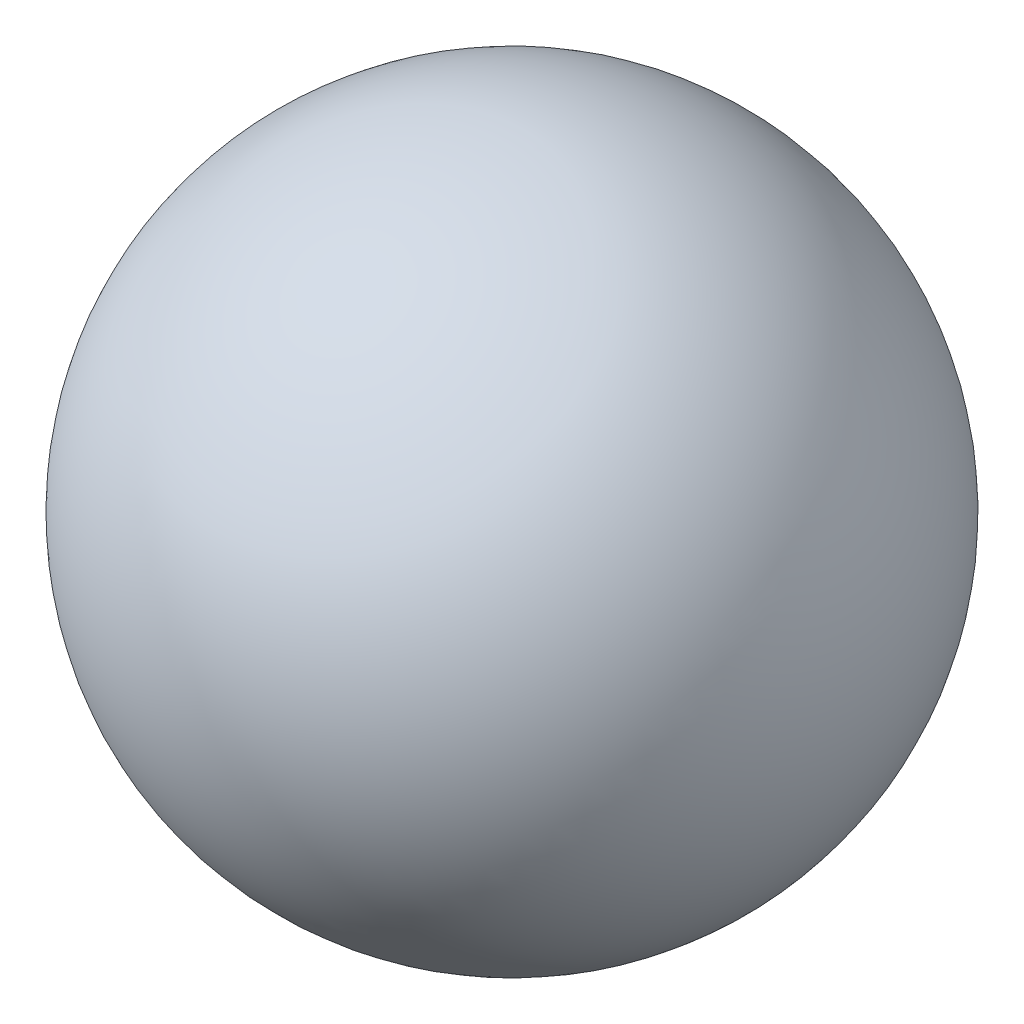
ISO-10303-21;
HEADER;
FILE_DESCRIPTION(('STEP AP214'),'2;1');
FILE_NAME('part.step','',(''),(''),'','','');
FILE_SCHEMA(('AUTOMOTIVE_DESIGN { 1 0 10303 214 1 1 1 1 }'));
ENDSEC;
DATA;
#1=APPLICATION_CONTEXT('core data for automotive mechanical design processes');
#2=APPLICATION_PROTOCOL_DEFINITION('international standard','automotive_design',2000,#1);
#3=PRODUCT_CONTEXT('',#1,'mechanical');
#4=PRODUCT('Part','Part','',(#3));
#5=PRODUCT_RELATED_PRODUCT_CATEGORY('part','',(#4));
#6=PRODUCT_DEFINITION_FORMATION('','',#4);
#7=PRODUCT_DEFINITION_CONTEXT('part definition',#1,'design');
#8=PRODUCT_DEFINITION('design','',#6,#7);
#9=PRODUCT_DEFINITION_SHAPE('','',#8);
#10=(LENGTH_UNIT() NAMED_UNIT(*) SI_UNIT(.MILLI.,.METRE.));
#11=(NAMED_UNIT(*) PLANE_ANGLE_UNIT() SI_UNIT($,.RADIAN.));
#12=(NAMED_UNIT(*) SI_UNIT($,.STERADIAN.) SOLID_ANGLE_UNIT());
#13=UNCERTAINTY_MEASURE_WITH_UNIT(LENGTH_MEASURE(1.E-05),#10,'distance_accuracy_value','');
#14=(GEOMETRIC_REPRESENTATION_CONTEXT(3) GLOBAL_UNCERTAINTY_ASSIGNED_CONTEXT((#13)) GLOBAL_UNIT_ASSIGNED_CONTEXT((#10,
#11,#12)) REPRESENTATION_CONTEXT('',''));
#15=CARTESIAN_POINT('',(0.,0.,0.));
#16=DIRECTION('',(0.,0.,1.));
#17=DIRECTION('',(1.,0.,0.));
#18=AXIS2_PLACEMENT_3D('',#15,#16,#17);
#19=CARTESIAN_POINT('',(49.75,-46.8428998199219,-24.7929372344375));
#20=DIRECTION('',(0.,-0.88383663657057,-0.467795681741101));
#21=DIRECTION('',(0.173648177666933,0.460688814204268,-0.870409172090931));
#22=AXIS2_PLACEMENT_3D('',#19,#20,#21);
#23=SPHERICAL_SURFACE('',#22,5.95);
#24=CARTESIAN_POINT('',(49.75,-41.584071832327,-22.0095529280779));
#25=VERTEX_POINT('',#24);
#26=VERTEX_LOOP('',#25);
#27=FACE_BOUND('',#26,.T.);
#28=CARTESIAN_POINT('',(49.75,-52.1017278075168,-27.576321540797));
#29=VERTEX_POINT('',#28);
#30=VERTEX_LOOP('',#29);
#31=FACE_BOUND('',#30,.T.);
#32=ADVANCED_FACE('F16',(#27,#31),#23,.T.);
#33=CLOSED_SHELL('',(#32));
#34=MANIFOLD_SOLID_BREP('B1',#33);
#35=ADVANCED_BREP_SHAPE_REPRESENTATION('',(#18,#34),#14);
#36=SHAPE_DEFINITION_REPRESENTATION(#9,#35);
ENDSEC;
END-ISO-10303-21;
